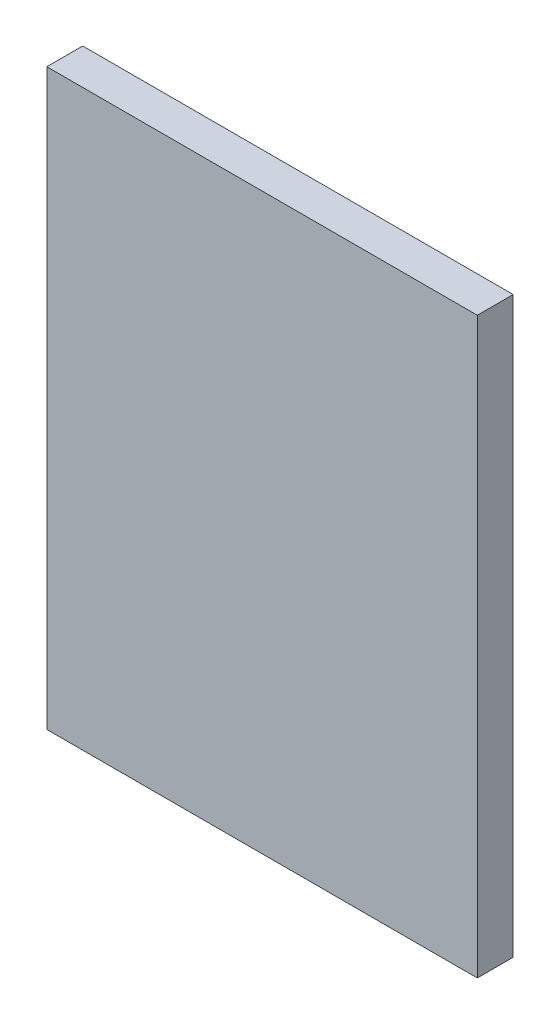
ISO-10303-21;
HEADER;
FILE_DESCRIPTION(('STEP AP214'),'2;1');
FILE_NAME('part.step','',(''),(''),'','','');
FILE_SCHEMA(('AUTOMOTIVE_DESIGN { 1 0 10303 214 1 1 1 1 }'));
ENDSEC;
DATA;
#1=APPLICATION_CONTEXT('core data for automotive mechanical design processes');
#2=APPLICATION_PROTOCOL_DEFINITION('international standard','automotive_design',2000,#1);
#3=PRODUCT_CONTEXT('',#1,'mechanical');
#4=PRODUCT('Part','Part','',(#3));
#5=PRODUCT_RELATED_PRODUCT_CATEGORY('part','',(#4));
#6=PRODUCT_DEFINITION_FORMATION('','',#4);
#7=PRODUCT_DEFINITION_CONTEXT('part definition',#1,'design');
#8=PRODUCT_DEFINITION('design','',#6,#7);
#9=PRODUCT_DEFINITION_SHAPE('','',#8);
#10=(LENGTH_UNIT() NAMED_UNIT(*) SI_UNIT(.MILLI.,.METRE.));
#11=(NAMED_UNIT(*) PLANE_ANGLE_UNIT() SI_UNIT($,.RADIAN.));
#12=(NAMED_UNIT(*) SI_UNIT($,.STERADIAN.) SOLID_ANGLE_UNIT());
#13=UNCERTAINTY_MEASURE_WITH_UNIT(LENGTH_MEASURE(1.E-05),#10,'distance_accuracy_value','');
#14=(GEOMETRIC_REPRESENTATION_CONTEXT(3) GLOBAL_UNCERTAINTY_ASSIGNED_CONTEXT((#13)) GLOBAL_UNIT_ASSIGNED_CONTEXT((#10,
#11,#12)) REPRESENTATION_CONTEXT('',''));
#15=CARTESIAN_POINT('',(0.,0.,0.));
#16=DIRECTION('',(0.,0.,1.));
#17=DIRECTION('',(1.,0.,0.));
#18=AXIS2_PLACEMENT_3D('',#15,#16,#17);
#19=CARTESIAN_POINT('',(19.05,-25.4,3.175));
#20=DIRECTION('',(-1.,0.,0.));
#21=DIRECTION('',(0.,0.,1.));
#22=AXIS2_PLACEMENT_3D('',#19,#20,#21);
#23=PLANE('',#22);
#24=DIRECTION('',(0.,1.,0.));
#25=VECTOR('',#24,1.);
#26=CARTESIAN_POINT('',(19.05,-25.4,0.));
#27=LINE('',#26,#25);
#28=CARTESIAN_POINT('',(19.05,-25.4,0.));
#29=VERTEX_POINT('',#28);
#30=CARTESIAN_POINT('',(19.05,25.4,0.));
#31=VERTEX_POINT('',#30);
#32=EDGE_CURVE('E107',#29,#31,#27,.T.);
#33=ORIENTED_EDGE('',*,*,#32,.T.);
#34=DIRECTION('',(0.,0.,-1.));
#35=VECTOR('',#34,1.);
#36=CARTESIAN_POINT('',(19.05,25.4,3.175));
#37=LINE('',#36,#35);
#38=CARTESIAN_POINT('',(19.05,25.4,3.175));
#39=VERTEX_POINT('',#38);
#40=EDGE_CURVE('E11',#39,#31,#37,.T.);
#41=ORIENTED_EDGE('',*,*,#40,.F.);
#42=DIRECTION('',(0.,1.,0.));
#43=VECTOR('',#42,1.);
#44=CARTESIAN_POINT('',(19.05,-25.4,3.175));
#45=LINE('',#44,#43);
#46=CARTESIAN_POINT('',(19.05,-25.4,3.175));
#47=VERTEX_POINT('',#46);
#48=EDGE_CURVE('E91',#47,#39,#45,.T.);
#49=ORIENTED_EDGE('',*,*,#48,.F.);
#50=DIRECTION('',(0.,0.,-1.));
#51=VECTOR('',#50,1.);
#52=CARTESIAN_POINT('',(19.05,-25.4,3.175));
#53=LINE('',#52,#51);
#54=EDGE_CURVE('E103',#47,#29,#53,.T.);
#55=ORIENTED_EDGE('',*,*,#54,.T.);
#56=EDGE_LOOP('',(#33,#41,#49,#55));
#57=FACE_BOUND('',#56,.T.);
#58=ADVANCED_FACE('F39',(#57),#23,.F.);
#59=CARTESIAN_POINT('',(-19.05,25.4,3.175));
#60=DIRECTION('',(0.,-1.,0.));
#61=DIRECTION('',(0.,0.,-1.));
#62=AXIS2_PLACEMENT_3D('',#59,#60,#61);
#63=PLANE('',#62);
#64=DIRECTION('',(-1.,0.,0.));
#65=VECTOR('',#64,1.);
#66=CARTESIAN_POINT('',(-19.05,25.4,0.));
#67=LINE('',#66,#65);
#68=CARTESIAN_POINT('',(-19.05,25.4,0.));
#69=VERTEX_POINT('',#68);
#70=EDGE_CURVE('E96',#31,#69,#67,.T.);
#71=ORIENTED_EDGE('',*,*,#70,.T.);
#72=DIRECTION('',(0.,0.,-1.));
#73=VECTOR('',#72,1.);
#74=CARTESIAN_POINT('',(-19.05,25.4,3.175));
#75=LINE('',#74,#73);
#76=CARTESIAN_POINT('',(-19.05,25.4,3.175));
#77=VERTEX_POINT('',#76);
#78=EDGE_CURVE('E48',#77,#69,#75,.T.);
#79=ORIENTED_EDGE('',*,*,#78,.F.);
#80=DIRECTION('',(-1.,0.,0.));
#81=VECTOR('',#80,1.);
#82=CARTESIAN_POINT('',(-19.05,25.4,3.175));
#83=LINE('',#82,#81);
#84=EDGE_CURVE('E86',#39,#77,#83,.T.);
#85=ORIENTED_EDGE('',*,*,#84,.F.);
#86=ORIENTED_EDGE('',*,*,#40,.T.);
#87=EDGE_LOOP('',(#71,#79,#85,#86));
#88=FACE_BOUND('',#87,.T.);
#89=ADVANCED_FACE('F95',(#88),#63,.F.);
#90=CARTESIAN_POINT('',(-19.05,-25.4,3.175));
#91=DIRECTION('',(1.,0.,0.));
#92=DIRECTION('',(0.,0.,-1.));
#93=AXIS2_PLACEMENT_3D('',#90,#91,#92);
#94=PLANE('',#93);
#95=DIRECTION('',(0.,-1.,0.));
#96=VECTOR('',#95,1.);
#97=CARTESIAN_POINT('',(-19.05,-25.4,0.));
#98=LINE('',#97,#96);
#99=CARTESIAN_POINT('',(-19.05,-25.4,0.));
#100=VERTEX_POINT('',#99);
#101=EDGE_CURVE('E73',#69,#100,#98,.T.);
#102=ORIENTED_EDGE('',*,*,#101,.T.);
#103=DIRECTION('',(0.,0.,-1.));
#104=VECTOR('',#103,1.);
#105=CARTESIAN_POINT('',(-19.05,-25.4,3.175));
#106=LINE('',#105,#104);
#107=CARTESIAN_POINT('',(-19.05,-25.4,3.175));
#108=VERTEX_POINT('',#107);
#109=EDGE_CURVE('E98',#108,#100,#106,.T.);
#110=ORIENTED_EDGE('',*,*,#109,.F.);
#111=DIRECTION('',(0.,-1.,0.));
#112=VECTOR('',#111,1.);
#113=CARTESIAN_POINT('',(-19.05,-25.4,3.175));
#114=LINE('',#113,#112);
#115=EDGE_CURVE('E89',#77,#108,#114,.T.);
#116=ORIENTED_EDGE('',*,*,#115,.F.);
#117=ORIENTED_EDGE('',*,*,#78,.T.);
#118=EDGE_LOOP('',(#102,#110,#116,#117));
#119=FACE_BOUND('',#118,.T.);
#120=ADVANCED_FACE('F99',(#119),#94,.F.);
#121=CARTESIAN_POINT('',(-19.05,-25.4,3.175));
#122=DIRECTION('',(0.,1.,0.));
#123=DIRECTION('',(0.,0.,1.));
#124=AXIS2_PLACEMENT_3D('',#121,#122,#123);
#125=PLANE('',#124);
#126=DIRECTION('',(1.,0.,0.));
#127=VECTOR('',#126,1.);
#128=CARTESIAN_POINT('',(-19.05,-25.4,0.));
#129=LINE('',#128,#127);
#130=EDGE_CURVE('E79',#100,#29,#129,.T.);
#131=ORIENTED_EDGE('',*,*,#130,.T.);
#132=ORIENTED_EDGE('',*,*,#54,.F.);
#133=DIRECTION('',(1.,0.,0.));
#134=VECTOR('',#133,1.);
#135=CARTESIAN_POINT('',(-19.05,-25.4,3.175));
#136=LINE('',#135,#134);
#137=EDGE_CURVE('E56',#108,#47,#136,.T.);
#138=ORIENTED_EDGE('',*,*,#137,.F.);
#139=ORIENTED_EDGE('',*,*,#109,.T.);
#140=EDGE_LOOP('',(#131,#132,#138,#139));
#141=FACE_BOUND('',#140,.T.);
#142=ADVANCED_FACE('F120',(#141),#125,.F.);
#143=CARTESIAN_POINT('',(0.,0.,3.175));
#144=DIRECTION('',(0.,0.,-1.));
#145=DIRECTION('',(-1.,0.,0.));
#146=AXIS2_PLACEMENT_3D('',#143,#144,#145);
#147=PLANE('',#146);
#148=ORIENTED_EDGE('',*,*,#48,.T.);
#149=ORIENTED_EDGE('',*,*,#84,.T.);
#150=ORIENTED_EDGE('',*,*,#115,.T.);
#151=ORIENTED_EDGE('',*,*,#137,.T.);
#152=EDGE_LOOP('',(#148,#149,#150,#151));
#153=FACE_BOUND('',#152,.T.);
#154=ADVANCED_FACE('F87',(#153),#147,.F.);
#155=CARTESIAN_POINT('',(0.,0.,0.));
#156=DIRECTION('',(0.,0.,-1.));
#157=DIRECTION('',(-1.,0.,0.));
#158=AXIS2_PLACEMENT_3D('',#155,#156,#157);
#159=PLANE('',#158);
#160=ORIENTED_EDGE('',*,*,#32,.F.);
#161=ORIENTED_EDGE('',*,*,#130,.F.);
#162=ORIENTED_EDGE('',*,*,#101,.F.);
#163=ORIENTED_EDGE('',*,*,#70,.F.);
#164=EDGE_LOOP('',(#160,#161,#162,#163));
#165=FACE_BOUND('',#164,.T.);
#166=ADVANCED_FACE('F123',(#165),#159,.T.);
#167=CLOSED_SHELL('',(#58,#89,#120,#142,#154,#166));
#168=MANIFOLD_SOLID_BREP('B2',#167);
#169=ADVANCED_BREP_SHAPE_REPRESENTATION('',(#18,#168),#14);
#170=SHAPE_DEFINITION_REPRESENTATION(#9,#169);
ENDSEC;
END-ISO-10303-21;
